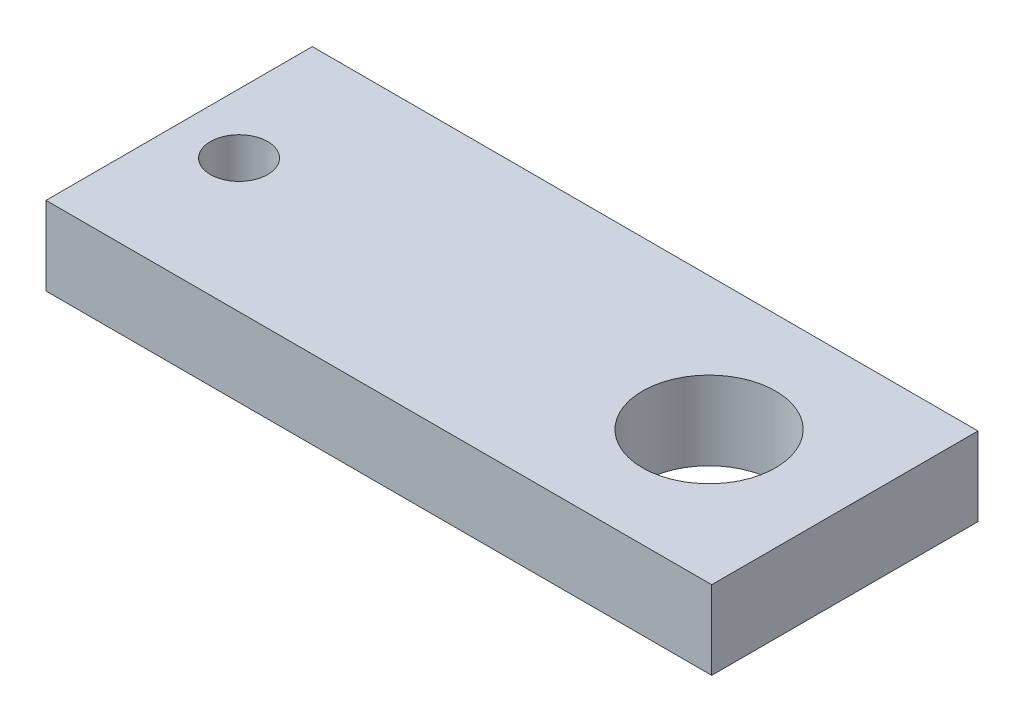
ISO-10303-21;
HEADER;
FILE_DESCRIPTION(('STEP AP214'),'2;1');
FILE_NAME('part.step','',(''),(''),'','','');
FILE_SCHEMA(('AUTOMOTIVE_DESIGN { 1 0 10303 214 1 1 1 1 }'));
ENDSEC;
DATA;
#1=APPLICATION_CONTEXT('core data for automotive mechanical design processes');
#2=APPLICATION_PROTOCOL_DEFINITION('international standard','automotive_design',2000,#1);
#3=PRODUCT_CONTEXT('',#1,'mechanical');
#4=PRODUCT('Part','Part','',(#3));
#5=PRODUCT_RELATED_PRODUCT_CATEGORY('part','',(#4));
#6=PRODUCT_DEFINITION_FORMATION('','',#4);
#7=PRODUCT_DEFINITION_CONTEXT('part definition',#1,'design');
#8=PRODUCT_DEFINITION('design','',#6,#7);
#9=PRODUCT_DEFINITION_SHAPE('','',#8);
#10=(LENGTH_UNIT() NAMED_UNIT(*) SI_UNIT(.MILLI.,.METRE.));
#11=(NAMED_UNIT(*) PLANE_ANGLE_UNIT() SI_UNIT($,.RADIAN.));
#12=(NAMED_UNIT(*) SI_UNIT($,.STERADIAN.) SOLID_ANGLE_UNIT());
#13=UNCERTAINTY_MEASURE_WITH_UNIT(LENGTH_MEASURE(1.E-05),#10,'distance_accuracy_value','');
#14=(GEOMETRIC_REPRESENTATION_CONTEXT(3) GLOBAL_UNCERTAINTY_ASSIGNED_CONTEXT((#13)) GLOBAL_UNIT_ASSIGNED_CONTEXT((#10,
#11,#12)) REPRESENTATION_CONTEXT('',''));
#15=CARTESIAN_POINT('',(0.,0.,0.));
#16=DIRECTION('',(0.,0.,1.));
#17=DIRECTION('',(1.,0.,0.));
#18=AXIS2_PLACEMENT_3D('',#15,#16,#17);
#19=CARTESIAN_POINT('',(0.,5.9,0.));
#20=DIRECTION('',(0.,-1.,0.));
#21=DIRECTION('',(0.,0.,-1.));
#22=AXIS2_PLACEMENT_3D('',#19,#20,#21);
#23=PLANE('',#22);
#24=DIRECTION('',(0.,0.,-1.));
#25=VECTOR('',#24,1.);
#26=CARTESIAN_POINT('',(25.,5.9,10.));
#27=LINE('',#26,#25);
#28=CARTESIAN_POINT('',(25.,5.9,10.));
#29=VERTEX_POINT('',#28);
#30=CARTESIAN_POINT('',(25.,5.9,-10.));
#31=VERTEX_POINT('',#30);
#32=EDGE_CURVE('E88',#29,#31,#27,.T.);
#33=ORIENTED_EDGE('',*,*,#32,.T.);
#34=DIRECTION('',(-1.,0.,0.));
#35=VECTOR('',#34,1.);
#36=CARTESIAN_POINT('',(-25.,5.9,-10.));
#37=LINE('',#36,#35);
#38=CARTESIAN_POINT('',(-25.,5.9,-10.));
#39=VERTEX_POINT('',#38);
#40=EDGE_CURVE('E83',#31,#39,#37,.T.);
#41=ORIENTED_EDGE('',*,*,#40,.T.);
#42=DIRECTION('',(0.,0.,1.));
#43=VECTOR('',#42,1.);
#44=CARTESIAN_POINT('',(-25.,5.9,10.));
#45=LINE('',#44,#43);
#46=CARTESIAN_POINT('',(-25.,5.9,10.));
#47=VERTEX_POINT('',#46);
#48=EDGE_CURVE('E86',#39,#47,#45,.T.);
#49=ORIENTED_EDGE('',*,*,#48,.T.);
#50=DIRECTION('',(1.,0.,0.));
#51=VECTOR('',#50,1.);
#52=CARTESIAN_POINT('',(-25.,5.9,10.));
#53=LINE('',#52,#51);
#54=EDGE_CURVE('E53',#47,#29,#53,.T.);
#55=ORIENTED_EDGE('',*,*,#54,.T.);
#56=EDGE_LOOP('',(#33,#41,#49,#55));
#57=FACE_BOUND('',#56,.T.);
#58=CARTESIAN_POINT('',(14.8,5.9,0.));
#59=DIRECTION('',(0.,1.,0.));
#60=DIRECTION('',(0.,0.,1.));
#61=AXIS2_PLACEMENT_3D('',#58,#59,#60);
#62=CIRCLE('',#61,5.);
#63=CARTESIAN_POINT('',(14.8,5.9,5.));
#64=VERTEX_POINT('',#63);
#65=EDGE_CURVE('E103',#64,#64,#62,.T.);
#66=ORIENTED_EDGE('',*,*,#65,.F.);
#67=EDGE_LOOP('',(#66));
#68=FACE_BOUND('',#67,.T.);
#69=CARTESIAN_POINT('',(-20.5,5.9,0.));
#70=DIRECTION('',(0.,1.,0.));
#71=DIRECTION('',(0.,0.,1.));
#72=AXIS2_PLACEMENT_3D('',#69,#70,#71);
#73=CIRCLE('',#72,2.15);
#74=CARTESIAN_POINT('',(-20.5,5.9,2.14999999999999));
#75=VERTEX_POINT('',#74);
#76=EDGE_CURVE('E118',#75,#75,#73,.T.);
#77=ORIENTED_EDGE('',*,*,#76,.F.);
#78=EDGE_LOOP('',(#77));
#79=FACE_BOUND('',#78,.T.);
#80=ADVANCED_FACE('F36',(#57,#68,#79),#23,.F.);
#81=CARTESIAN_POINT('',(0.,0.,0.));
#82=DIRECTION('',(0.,-1.,0.));
#83=DIRECTION('',(0.,0.,-1.));
#84=AXIS2_PLACEMENT_3D('',#81,#82,#83);
#85=PLANE('',#84);
#86=CARTESIAN_POINT('',(14.8,0.,0.));
#87=DIRECTION('',(0.,1.,0.));
#88=DIRECTION('',(0.,0.,1.));
#89=AXIS2_PLACEMENT_3D('',#86,#87,#88);
#90=CIRCLE('',#89,5.);
#91=CARTESIAN_POINT('',(14.8,0.,5.));
#92=VERTEX_POINT('',#91);
#93=EDGE_CURVE('E115',#92,#92,#90,.T.);
#94=ORIENTED_EDGE('',*,*,#93,.T.);
#95=EDGE_LOOP('',(#94));
#96=FACE_BOUND('',#95,.T.);
#97=DIRECTION('',(0.,0.,-1.));
#98=VECTOR('',#97,1.);
#99=CARTESIAN_POINT('',(25.,0.,10.));
#100=LINE('',#99,#98);
#101=CARTESIAN_POINT('',(25.,0.,10.));
#102=VERTEX_POINT('',#101);
#103=CARTESIAN_POINT('',(25.,0.,-10.));
#104=VERTEX_POINT('',#103);
#105=EDGE_CURVE('E100',#102,#104,#100,.T.);
#106=ORIENTED_EDGE('',*,*,#105,.F.);
#107=DIRECTION('',(1.,0.,0.));
#108=VECTOR('',#107,1.);
#109=CARTESIAN_POINT('',(-25.,0.,10.));
#110=LINE('',#109,#108);
#111=CARTESIAN_POINT('',(-25.,0.,10.));
#112=VERTEX_POINT('',#111);
#113=EDGE_CURVE('E76',#112,#102,#110,.T.);
#114=ORIENTED_EDGE('',*,*,#113,.F.);
#115=DIRECTION('',(0.,0.,1.));
#116=VECTOR('',#115,1.);
#117=CARTESIAN_POINT('',(-25.,0.,10.));
#118=LINE('',#117,#116);
#119=CARTESIAN_POINT('',(-25.,0.,-10.));
#120=VERTEX_POINT('',#119);
#121=EDGE_CURVE('E70',#120,#112,#118,.T.);
#122=ORIENTED_EDGE('',*,*,#121,.F.);
#123=DIRECTION('',(-1.,0.,0.));
#124=VECTOR('',#123,1.);
#125=CARTESIAN_POINT('',(-25.,0.,-10.));
#126=LINE('',#125,#124);
#127=EDGE_CURVE('E92',#104,#120,#126,.T.);
#128=ORIENTED_EDGE('',*,*,#127,.F.);
#129=EDGE_LOOP('',(#106,#114,#122,#128));
#130=FACE_BOUND('',#129,.T.);
#131=CARTESIAN_POINT('',(-20.5,0.,0.));
#132=DIRECTION('',(0.,1.,0.));
#133=DIRECTION('',(0.,0.,1.));
#134=AXIS2_PLACEMENT_3D('',#131,#132,#133);
#135=CIRCLE('',#134,2.15);
#136=CARTESIAN_POINT('',(-20.5,0.,2.14999999999999));
#137=VERTEX_POINT('',#136);
#138=EDGE_CURVE('E121',#137,#137,#135,.T.);
#139=ORIENTED_EDGE('',*,*,#138,.T.);
#140=EDGE_LOOP('',(#139));
#141=FACE_BOUND('',#140,.T.);
#142=ADVANCED_FACE('F111',(#96,#130,#141),#85,.T.);
#143=CARTESIAN_POINT('',(25.,5.9,10.));
#144=DIRECTION('',(-1.,0.,0.));
#145=DIRECTION('',(0.,0.,1.));
#146=AXIS2_PLACEMENT_3D('',#143,#144,#145);
#147=PLANE('',#146);
#148=ORIENTED_EDGE('',*,*,#105,.T.);
#149=DIRECTION('',(0.,-1.,0.));
#150=VECTOR('',#149,1.);
#151=CARTESIAN_POINT('',(25.,5.9,-10.));
#152=LINE('',#151,#150);
#153=EDGE_CURVE('E11',#31,#104,#152,.T.);
#154=ORIENTED_EDGE('',*,*,#153,.F.);
#155=ORIENTED_EDGE('',*,*,#32,.F.);
#156=DIRECTION('',(0.,-1.,0.));
#157=VECTOR('',#156,1.);
#158=CARTESIAN_POINT('',(25.,5.9,10.));
#159=LINE('',#158,#157);
#160=EDGE_CURVE('E96',#29,#102,#159,.T.);
#161=ORIENTED_EDGE('',*,*,#160,.T.);
#162=EDGE_LOOP('',(#148,#154,#155,#161));
#163=FACE_BOUND('',#162,.T.);
#164=ADVANCED_FACE('F38',(#163),#147,.F.);
#165=CARTESIAN_POINT('',(-25.,5.9,-10.));
#166=DIRECTION('',(0.,0.,1.));
#167=DIRECTION('',(1.,0.,0.));
#168=AXIS2_PLACEMENT_3D('',#165,#166,#167);
#169=PLANE('',#168);
#170=ORIENTED_EDGE('',*,*,#127,.T.);
#171=DIRECTION('',(0.,-1.,0.));
#172=VECTOR('',#171,1.);
#173=CARTESIAN_POINT('',(-25.,5.9,-10.));
#174=LINE('',#173,#172);
#175=EDGE_CURVE('E45',#39,#120,#174,.T.);
#176=ORIENTED_EDGE('',*,*,#175,.F.);
#177=ORIENTED_EDGE('',*,*,#40,.F.);
#178=ORIENTED_EDGE('',*,*,#153,.T.);
#179=EDGE_LOOP('',(#170,#176,#177,#178));
#180=FACE_BOUND('',#179,.T.);
#181=ADVANCED_FACE('F91',(#180),#169,.F.);
#182=CARTESIAN_POINT('',(-25.,5.9,10.));
#183=DIRECTION('',(1.,0.,0.));
#184=DIRECTION('',(0.,0.,-1.));
#185=AXIS2_PLACEMENT_3D('',#182,#183,#184);
#186=PLANE('',#185);
#187=ORIENTED_EDGE('',*,*,#121,.T.);
#188=DIRECTION('',(0.,-1.,0.));
#189=VECTOR('',#188,1.);
#190=CARTESIAN_POINT('',(-25.,5.9,10.));
#191=LINE('',#190,#189);
#192=EDGE_CURVE('E93',#47,#112,#191,.T.);
#193=ORIENTED_EDGE('',*,*,#192,.F.);
#194=ORIENTED_EDGE('',*,*,#48,.F.);
#195=ORIENTED_EDGE('',*,*,#175,.T.);
#196=EDGE_LOOP('',(#187,#193,#194,#195));
#197=FACE_BOUND('',#196,.T.);
#198=ADVANCED_FACE('F94',(#197),#186,.F.);
#199=CARTESIAN_POINT('',(-25.,5.9,10.));
#200=DIRECTION('',(0.,0.,-1.));
#201=DIRECTION('',(-1.,0.,0.));
#202=AXIS2_PLACEMENT_3D('',#199,#200,#201);
#203=PLANE('',#202);
#204=ORIENTED_EDGE('',*,*,#113,.T.);
#205=ORIENTED_EDGE('',*,*,#160,.F.);
#206=ORIENTED_EDGE('',*,*,#54,.F.);
#207=ORIENTED_EDGE('',*,*,#192,.T.);
#208=EDGE_LOOP('',(#204,#205,#206,#207));
#209=FACE_BOUND('',#208,.T.);
#210=ADVANCED_FACE('F108',(#209),#203,.F.);
#211=CARTESIAN_POINT('',(14.8,5.9,0.));
#212=DIRECTION('',(0.,-1.,0.));
#213=DIRECTION('',(0.,0.,-1.));
#214=AXIS2_PLACEMENT_3D('',#211,#212,#213);
#215=CYLINDRICAL_SURFACE('',#214,5.);
#216=ORIENTED_EDGE('',*,*,#65,.T.);
#217=EDGE_LOOP('',(#216));
#218=FACE_BOUND('',#217,.T.);
#219=ORIENTED_EDGE('',*,*,#93,.F.);
#220=EDGE_LOOP('',(#219));
#221=FACE_BOUND('',#220,.T.);
#222=ADVANCED_FACE('F138',(#218,#221),#215,.F.);
#223=CARTESIAN_POINT('',(-20.5,5.9,0.));
#224=DIRECTION('',(0.,-1.,0.));
#225=DIRECTION('',(0.,0.,-1.));
#226=AXIS2_PLACEMENT_3D('',#223,#224,#225);
#227=CYLINDRICAL_SURFACE('',#226,2.15);
#228=ORIENTED_EDGE('',*,*,#76,.T.);
#229=EDGE_LOOP('',(#228));
#230=FACE_BOUND('',#229,.T.);
#231=ORIENTED_EDGE('',*,*,#138,.F.);
#232=EDGE_LOOP('',(#231));
#233=FACE_BOUND('',#232,.T.);
#234=ADVANCED_FACE('F127',(#230,#233),#227,.F.);
#235=CLOSED_SHELL('',(#80,#142,#164,#181,#198,#210,#222,#234));
#236=MANIFOLD_SOLID_BREP('B2',#235);
#237=ADVANCED_BREP_SHAPE_REPRESENTATION('',(#18,#236),#14);
#238=SHAPE_DEFINITION_REPRESENTATION(#9,#237);
ENDSEC;
END-ISO-10303-21;
